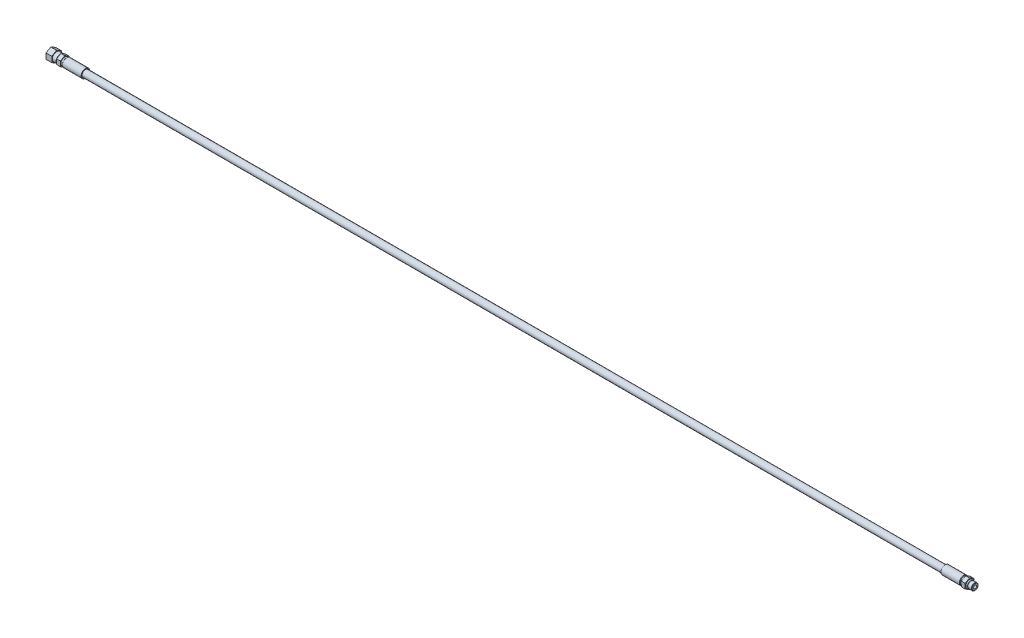
ISO-10303-21;
HEADER;
FILE_DESCRIPTION(('STEP AP214'),'2;1');
FILE_NAME('part.step','',(''),(''),'','','');
FILE_SCHEMA(('AUTOMOTIVE_DESIGN { 1 0 10303 214 1 1 1 1 }'));
ENDSEC;
DATA;
#1=APPLICATION_CONTEXT('core data for automotive mechanical design processes');
#2=APPLICATION_PROTOCOL_DEFINITION('international standard','automotive_design',2000,#1);
#3=PRODUCT_CONTEXT('',#1,'mechanical');
#4=PRODUCT('Part','Part','',(#3));
#5=PRODUCT_RELATED_PRODUCT_CATEGORY('part','',(#4));
#6=PRODUCT_DEFINITION_FORMATION('','',#4);
#7=PRODUCT_DEFINITION_CONTEXT('part definition',#1,'design');
#8=PRODUCT_DEFINITION('design','',#6,#7);
#9=PRODUCT_DEFINITION_SHAPE('','',#8);
#10=(LENGTH_UNIT() NAMED_UNIT(*) SI_UNIT(.MILLI.,.METRE.));
#11=(NAMED_UNIT(*) PLANE_ANGLE_UNIT() SI_UNIT($,.RADIAN.));
#12=(NAMED_UNIT(*) SI_UNIT($,.STERADIAN.) SOLID_ANGLE_UNIT());
#13=UNCERTAINTY_MEASURE_WITH_UNIT(LENGTH_MEASURE(1.E-05),#10,'distance_accuracy_value','');
#14=(GEOMETRIC_REPRESENTATION_CONTEXT(3) GLOBAL_UNCERTAINTY_ASSIGNED_CONTEXT((#13)) GLOBAL_UNIT_ASSIGNED_CONTEXT((#10,
#11,#12)) REPRESENTATION_CONTEXT('',''));
#15=CARTESIAN_POINT('',(0.,0.,0.));
#16=DIRECTION('',(0.,0.,1.));
#17=DIRECTION('',(1.,0.,0.));
#18=AXIS2_PLACEMENT_3D('',#15,#16,#17);
#19=CARTESIAN_POINT('',(-8.128,0.,0.));
#20=DIRECTION('',(-1.,0.,0.));
#21=DIRECTION('',(0.,0.,1.));
#22=AXIS2_PLACEMENT_3D('',#19,#20,#21);
#23=TOROIDAL_SURFACE('',#22,5.588,1.016);
#24=CARTESIAN_POINT('',(-8.128,0.,6.604));
#25=VERTEX_POINT('',#24);
#26=VERTEX_LOOP('',#25);
#27=FACE_BOUND('',#26,.T.);
#28=ADVANCED_FACE('F41',(#27),#23,.T.);
#29=CLOSED_SHELL('',(#28));
#30=MANIFOLD_SOLID_BREP('B2',#29);
#31=CARTESIAN_POINT('',(-1514.475,7.11199999999982,0.));
#32=DIRECTION('',(-1.,0.,0.));
#33=DIRECTION('',(0.,0.,1.));
#34=AXIS2_PLACEMENT_3D('',#31,#32,#33);
#35=PLANE('',#34);
#36=CARTESIAN_POINT('',(-1514.475,0.,0.));
#37=DIRECTION('',(-1.,0.,0.));
#38=DIRECTION('',(0.,0.,1.));
#39=AXIS2_PLACEMENT_3D('',#36,#37,#38);
#40=CIRCLE('',#39,7.11199999999982);
#41=CARTESIAN_POINT('',(-1514.475,0.,7.11199999999982));
#42=VERTEX_POINT('',#41);
#43=EDGE_CURVE('E321',#42,#42,#40,.T.);
#44=ORIENTED_EDGE('',*,*,#43,.T.);
#45=EDGE_LOOP('',(#44));
#46=FACE_BOUND('',#45,.T.);
#47=DIRECTION('',(0.,-0.5,0.866025403784439));
#48=VECTOR('',#47,1.);
#49=CARTESIAN_POINT('',(-1514.475,4.58271776169265,7.9375));
#50=LINE('',#49,#48);
#51=CARTESIAN_POINT('',(-1514.475,9.16543552338531,0.));
#52=VERTEX_POINT('',#51);
#53=CARTESIAN_POINT('',(-1514.475,4.58271776169265,7.9375));
#54=VERTEX_POINT('',#53);
#55=EDGE_CURVE('E210',#52,#54,#50,.T.);
#56=ORIENTED_EDGE('',*,*,#55,.T.);
#57=DIRECTION('',(0.,-1.,0.));
#58=VECTOR('',#57,1.);
#59=CARTESIAN_POINT('',(-1514.475,-4.58271776169266,7.9375));
#60=LINE('',#59,#58);
#61=CARTESIAN_POINT('',(-1514.475,-4.58271776169266,7.9375));
#62=VERTEX_POINT('',#61);
#63=EDGE_CURVE('E207',#54,#62,#60,.T.);
#64=ORIENTED_EDGE('',*,*,#63,.T.);
#65=DIRECTION('',(0.,-0.5,-0.866025403784439));
#66=VECTOR('',#65,1.);
#67=CARTESIAN_POINT('',(-1514.475,-9.16543552338531,0.));
#68=LINE('',#67,#66);
#69=CARTESIAN_POINT('',(-1514.475,-9.16543552338531,0.));
#70=VERTEX_POINT('',#69);
#71=EDGE_CURVE('E199',#62,#70,#68,.T.);
#72=ORIENTED_EDGE('',*,*,#71,.T.);
#73=DIRECTION('',(0.,0.5,-0.866025403784439));
#74=VECTOR('',#73,1.);
#75=CARTESIAN_POINT('',(-1514.475,-4.58271776169266,-7.9375));
#76=LINE('',#75,#74);
#77=CARTESIAN_POINT('',(-1514.475,-4.58271776169266,-7.9375));
#78=VERTEX_POINT('',#77);
#79=EDGE_CURVE('E197',#70,#78,#76,.T.);
#80=ORIENTED_EDGE('',*,*,#79,.T.);
#81=DIRECTION('',(0.,1.,0.));
#82=VECTOR('',#81,1.);
#83=CARTESIAN_POINT('',(-1514.475,4.58271776169266,-7.9375));
#84=LINE('',#83,#82);
#85=CARTESIAN_POINT('',(-1514.475,4.58271776169266,-7.9375));
#86=VERTEX_POINT('',#85);
#87=EDGE_CURVE('E191',#78,#86,#84,.T.);
#88=ORIENTED_EDGE('',*,*,#87,.T.);
#89=DIRECTION('',(0.,0.5,0.866025403784439));
#90=VECTOR('',#89,1.);
#91=CARTESIAN_POINT('',(-1514.475,9.16543552338531,0.));
#92=LINE('',#91,#90);
#93=EDGE_CURVE('E180',#86,#52,#92,.T.);
#94=ORIENTED_EDGE('',*,*,#93,.T.);
#95=EDGE_LOOP('',(#56,#64,#72,#80,#88,#94));
#96=FACE_BOUND('',#95,.T.);
#97=ADVANCED_FACE('F55',(#46,#96),#35,.F.);
#98=CARTESIAN_POINT('',(-1524.,19.0499999999999,0.));
#99=DIRECTION('',(1.,0.,0.));
#100=DIRECTION('',(0.,0.,-1.));
#101=AXIS2_PLACEMENT_3D('',#98,#99,#100);
#102=PLANE('',#101);
#103=CARTESIAN_POINT('',(-1524.,0.,0.));
#104=DIRECTION('',(1.,0.,0.));
#105=DIRECTION('',(0.,0.,-1.));
#106=AXIS2_PLACEMENT_3D('',#103,#104,#105);
#107=CIRCLE('',#106,6.19989534470758);
#108=CARTESIAN_POINT('',(-1524.,0.,-6.19989534470758));
#109=VERTEX_POINT('',#108);
#110=EDGE_CURVE('E549',#109,#109,#107,.T.);
#111=ORIENTED_EDGE('',*,*,#110,.T.);
#112=EDGE_LOOP('',(#111));
#113=FACE_BOUND('',#112,.T.);
#114=DIRECTION('',(0.,0.5,-0.866025403784438));
#115=VECTOR('',#114,1.);
#116=CARTESIAN_POINT('',(-1524.,4.58271776169265,7.9375));
#117=LINE('',#116,#115);
#118=CARTESIAN_POINT('',(-1524.,4.58271776169265,7.9375));
#119=VERTEX_POINT('',#118);
#120=CARTESIAN_POINT('',(-1524.,9.16543552338531,0.));
#121=VERTEX_POINT('',#120);
#122=EDGE_CURVE('E212',#119,#121,#117,.T.);
#123=ORIENTED_EDGE('',*,*,#122,.T.);
#124=DIRECTION('',(0.,-0.5,-0.866025403784439));
#125=VECTOR('',#124,1.);
#126=CARTESIAN_POINT('',(-1524.,9.16543552338531,0.));
#127=LINE('',#126,#125);
#128=CARTESIAN_POINT('',(-1524.,4.58271776169266,-7.9375));
#129=VERTEX_POINT('',#128);
#130=EDGE_CURVE('E215',#121,#129,#127,.T.);
#131=ORIENTED_EDGE('',*,*,#130,.T.);
#132=DIRECTION('',(0.,-1.,0.));
#133=VECTOR('',#132,1.);
#134=CARTESIAN_POINT('',(-1524.,4.58271776169266,-7.9375));
#135=LINE('',#134,#133);
#136=CARTESIAN_POINT('',(-1524.,-4.58271776169266,-7.9375));
#137=VERTEX_POINT('',#136);
#138=EDGE_CURVE('E79',#129,#137,#135,.T.);
#139=ORIENTED_EDGE('',*,*,#138,.T.);
#140=DIRECTION('',(0.,-0.5,0.866025403784439));
#141=VECTOR('',#140,1.);
#142=CARTESIAN_POINT('',(-1524.,-4.58271776169266,-7.9375));
#143=LINE('',#142,#141);
#144=CARTESIAN_POINT('',(-1524.,-9.16543552338531,0.));
#145=VERTEX_POINT('',#144);
#146=EDGE_CURVE('E218',#137,#145,#143,.T.);
#147=ORIENTED_EDGE('',*,*,#146,.T.);
#148=DIRECTION('',(0.,0.5,0.866025403784439));
#149=VECTOR('',#148,1.);
#150=CARTESIAN_POINT('',(-1524.,-9.16543552338531,0.));
#151=LINE('',#150,#149);
#152=CARTESIAN_POINT('',(-1524.,-4.58271776169266,7.9375));
#153=VERTEX_POINT('',#152);
#154=EDGE_CURVE('E221',#145,#153,#151,.T.);
#155=ORIENTED_EDGE('',*,*,#154,.T.);
#156=DIRECTION('',(0.,1.,0.));
#157=VECTOR('',#156,1.);
#158=CARTESIAN_POINT('',(-1524.,-4.58271776169266,7.9375));
#159=LINE('',#158,#157);
#160=EDGE_CURVE('E224',#153,#119,#159,.T.);
#161=ORIENTED_EDGE('',*,*,#160,.T.);
#162=EDGE_LOOP('',(#123,#131,#139,#147,#155,#161));
#163=FACE_BOUND('',#162,.T.);
#164=ADVANCED_FACE('F391',(#113,#163),#102,.F.);
#165=CARTESIAN_POINT('',(-9.144,4.6228,0.));
#166=DIRECTION('',(-1.,0.,0.));
#167=DIRECTION('',(0.,0.,1.));
#168=AXIS2_PLACEMENT_3D('',#165,#166,#167);
#169=PLANE('',#168);
#170=CARTESIAN_POINT('',(-9.144,0.,0.));
#171=DIRECTION('',(-1.,0.,0.));
#172=DIRECTION('',(0.,0.,1.));
#173=AXIS2_PLACEMENT_3D('',#170,#171,#172);
#174=CIRCLE('',#173,4.6228);
#175=CARTESIAN_POINT('',(-9.144,0.,4.6228));
#176=VERTEX_POINT('',#175);
#177=EDGE_CURVE('E363',#176,#176,#174,.T.);
#178=ORIENTED_EDGE('',*,*,#177,.T.);
#179=EDGE_LOOP('',(#178));
#180=FACE_BOUND('',#179,.T.);
#181=DIRECTION('',(0.,-0.5,0.866025403784439));
#182=VECTOR('',#181,1.);
#183=CARTESIAN_POINT('',(-9.144,8.21223022895324,0.));
#184=LINE('',#183,#182);
#185=CARTESIAN_POINT('',(-9.144,8.21223022895324,0.));
#186=VERTEX_POINT('',#185);
#187=CARTESIAN_POINT('',(-9.144,4.10611511447662,7.112));
#188=VERTEX_POINT('',#187);
#189=EDGE_CURVE('E253',#186,#188,#184,.T.);
#190=ORIENTED_EDGE('',*,*,#189,.T.);
#191=DIRECTION('',(0.,-1.,0.));
#192=VECTOR('',#191,1.);
#193=CARTESIAN_POINT('',(-9.144,4.10611511447662,7.112));
#194=LINE('',#193,#192);
#195=CARTESIAN_POINT('',(-9.144,-4.10611511447662,7.112));
#196=VERTEX_POINT('',#195);
#197=EDGE_CURVE('E256',#188,#196,#194,.T.);
#198=ORIENTED_EDGE('',*,*,#197,.T.);
#199=DIRECTION('',(0.,-0.5,-0.866025403784439));
#200=VECTOR('',#199,1.);
#201=CARTESIAN_POINT('',(-9.144,-4.10611511447662,7.112));
#202=LINE('',#201,#200);
#203=CARTESIAN_POINT('',(-9.144,-8.21223022895323,0.));
#204=VERTEX_POINT('',#203);
#205=EDGE_CURVE('E259',#196,#204,#202,.T.);
#206=ORIENTED_EDGE('',*,*,#205,.T.);
#207=DIRECTION('',(0.,0.5,-0.866025403784439));
#208=VECTOR('',#207,1.);
#209=CARTESIAN_POINT('',(-9.144,-8.21223022895323,0.));
#210=LINE('',#209,#208);
#211=CARTESIAN_POINT('',(-9.144,-4.10611511447662,-7.11200000000001));
#212=VERTEX_POINT('',#211);
#213=EDGE_CURVE('E262',#204,#212,#210,.T.);
#214=ORIENTED_EDGE('',*,*,#213,.T.);
#215=DIRECTION('',(0.,1.,0.));
#216=VECTOR('',#215,1.);
#217=CARTESIAN_POINT('',(-9.144,-4.10611511447662,-7.11200000000001));
#218=LINE('',#217,#216);
#219=CARTESIAN_POINT('',(-9.144,4.10611511447662,-7.112));
#220=VERTEX_POINT('',#219);
#221=EDGE_CURVE('E265',#212,#220,#218,.T.);
#222=ORIENTED_EDGE('',*,*,#221,.T.);
#223=DIRECTION('',(0.,0.5,0.866025403784439));
#224=VECTOR('',#223,1.);
#225=CARTESIAN_POINT('',(-9.144,4.10611511447662,-7.112));
#226=LINE('',#225,#224);
#227=EDGE_CURVE('E187',#220,#186,#226,.T.);
#228=ORIENTED_EDGE('',*,*,#227,.T.);
#229=EDGE_LOOP('',(#190,#198,#206,#214,#222,#228));
#230=FACE_BOUND('',#229,.T.);
#231=ADVANCED_FACE('F397',(#180,#230),#169,.F.);
#232=CARTESIAN_POINT('',(-1507.363,19.0499999999999,0.));
#233=DIRECTION('',(1.,0.,0.));
#234=DIRECTION('',(0.,0.,-1.));
#235=AXIS2_PLACEMENT_3D('',#232,#233,#234);
#236=PLANE('',#235);
#237=CARTESIAN_POINT('',(-1507.363,0.,0.));
#238=DIRECTION('',(-1.,0.,0.));
#239=DIRECTION('',(0.,0.,1.));
#240=AXIS2_PLACEMENT_3D('',#237,#238,#239);
#241=CIRCLE('',#240,6.34999999999982);
#242=CARTESIAN_POINT('',(-1507.363,0.,6.34999999999982));
#243=VERTEX_POINT('',#242);
#244=EDGE_CURVE('E330',#243,#243,#241,.T.);
#245=ORIENTED_EDGE('',*,*,#244,.F.);
#246=EDGE_LOOP('',(#245));
#247=FACE_BOUND('',#246,.T.);
#248=DIRECTION('',(0.,0.5,-0.866025403784439));
#249=VECTOR('',#248,1.);
#250=CARTESIAN_POINT('',(-1507.363,8.21223022895324,0.));
#251=LINE('',#250,#249);
#252=CARTESIAN_POINT('',(-1507.363,4.10611511447663,7.112));
#253=VERTEX_POINT('',#252);
#254=CARTESIAN_POINT('',(-1507.363,8.21223022895324,0.));
#255=VERTEX_POINT('',#254);
#256=EDGE_CURVE('E250',#253,#255,#251,.T.);
#257=ORIENTED_EDGE('',*,*,#256,.T.);
#258=DIRECTION('',(0.,-0.5,-0.866025403784439));
#259=VECTOR('',#258,1.);
#260=CARTESIAN_POINT('',(-1507.363,4.10611511447662,-7.112));
#261=LINE('',#260,#259);
#262=CARTESIAN_POINT('',(-1507.363,4.10611511447662,-7.112));
#263=VERTEX_POINT('',#262);
#264=EDGE_CURVE('E247',#255,#263,#261,.T.);
#265=ORIENTED_EDGE('',*,*,#264,.T.);
#266=DIRECTION('',(0.,-1.,0.));
#267=VECTOR('',#266,1.);
#268=CARTESIAN_POINT('',(-1507.363,-4.10611511447662,-7.11200000000001));
#269=LINE('',#268,#267);
#270=CARTESIAN_POINT('',(-1507.363,-4.10611511447662,-7.11200000000001));
#271=VERTEX_POINT('',#270);
#272=EDGE_CURVE('E244',#263,#271,#269,.T.);
#273=ORIENTED_EDGE('',*,*,#272,.T.);
#274=DIRECTION('',(0.,-0.5,0.866025403784439));
#275=VECTOR('',#274,1.);
#276=CARTESIAN_POINT('',(-1507.363,-8.21223022895323,0.));
#277=LINE('',#276,#275);
#278=CARTESIAN_POINT('',(-1507.363,-8.21223022895323,0.));
#279=VERTEX_POINT('',#278);
#280=EDGE_CURVE('E241',#271,#279,#277,.T.);
#281=ORIENTED_EDGE('',*,*,#280,.T.);
#282=DIRECTION('',(0.,0.5,0.866025403784439));
#283=VECTOR('',#282,1.);
#284=CARTESIAN_POINT('',(-1507.363,-4.10611511447662,7.112));
#285=LINE('',#284,#283);
#286=CARTESIAN_POINT('',(-1507.363,-4.10611511447662,7.112));
#287=VERTEX_POINT('',#286);
#288=EDGE_CURVE('E238',#279,#287,#285,.T.);
#289=ORIENTED_EDGE('',*,*,#288,.T.);
#290=DIRECTION('',(0.,1.,0.));
#291=VECTOR('',#290,1.);
#292=CARTESIAN_POINT('',(-1507.363,4.10611511447662,7.112));
#293=LINE('',#292,#291);
#294=EDGE_CURVE('E234',#287,#253,#293,.T.);
#295=ORIENTED_EDGE('',*,*,#294,.T.);
#296=EDGE_LOOP('',(#257,#265,#273,#281,#289,#295));
#297=FACE_BOUND('',#296,.T.);
#298=ADVANCED_FACE('F416',(#247,#297),#236,.F.);
#299=CARTESIAN_POINT('',(0.,2.413,0.));
#300=DIRECTION('',(-1.,0.,0.));
#301=DIRECTION('',(0.,0.,1.));
#302=AXIS2_PLACEMENT_3D('',#299,#300,#301);
#303=PLANE('',#302);
#304=CARTESIAN_POINT('',(0.,0.,0.));
#305=DIRECTION('',(-1.,0.,0.));
#306=DIRECTION('',(0.,0.,1.));
#307=AXIS2_PLACEMENT_3D('',#304,#305,#306);
#308=CIRCLE('',#307,4.85139999999995);
#309=CARTESIAN_POINT('',(0.,0.,4.85139999999995));
#310=VERTEX_POINT('',#309);
#311=EDGE_CURVE('E39',#310,#310,#308,.F.);
#312=ORIENTED_EDGE('',*,*,#311,.T.);
#313=EDGE_LOOP('',(#312));
#314=FACE_BOUND('',#313,.T.);
#315=CARTESIAN_POINT('',(0.,0.,0.));
#316=DIRECTION('',(-1.,0.,0.));
#317=DIRECTION('',(0.,0.,1.));
#318=AXIS2_PLACEMENT_3D('',#315,#316,#317);
#319=CIRCLE('',#318,2.413);
#320=CARTESIAN_POINT('',(0.,0.,2.413));
#321=VERTEX_POINT('',#320);
#322=EDGE_CURVE('E318',#321,#321,#319,.T.);
#323=ORIENTED_EDGE('',*,*,#322,.T.);
#324=EDGE_LOOP('',(#323));
#325=FACE_BOUND('',#324,.T.);
#326=ADVANCED_FACE('F419',(#314,#325),#303,.F.);
#327=CARTESIAN_POINT('',(0.,0.,0.));
#328=DIRECTION('',(-1.,0.,0.));
#329=DIRECTION('',(0.,0.,1.));
#330=AXIS2_PLACEMENT_3D('',#327,#328,#329);
#331=CYLINDRICAL_SURFACE('',#330,5.5372);
#332=CARTESIAN_POINT('',(-0.68580000000003,0.,0.));
#333=DIRECTION('',(-1.,0.,0.));
#334=DIRECTION('',(0.,0.,1.));
#335=AXIS2_PLACEMENT_3D('',#332,#333,#334);
#336=CIRCLE('',#335,5.5372);
#337=CARTESIAN_POINT('',(-0.68580000000003,0.,5.5372));
#338=VERTEX_POINT('',#337);
#339=EDGE_CURVE('E64',#338,#338,#336,.T.);
#340=ORIENTED_EDGE('',*,*,#339,.T.);
#341=EDGE_LOOP('',(#340));
#342=FACE_BOUND('',#341,.T.);
#343=CARTESIAN_POINT('',(-6.3246,0.,0.));
#344=DIRECTION('',(-1.,0.,0.));
#345=DIRECTION('',(0.,0.,1.));
#346=AXIS2_PLACEMENT_3D('',#343,#344,#345);
#347=CIRCLE('',#346,5.5372);
#348=CARTESIAN_POINT('',(-6.3246,0.,5.5372));
#349=VERTEX_POINT('',#348);
#350=EDGE_CURVE('E369',#349,#349,#347,.T.);
#351=ORIENTED_EDGE('',*,*,#350,.F.);
#352=EDGE_LOOP('',(#351));
#353=FACE_BOUND('',#352,.T.);
#354=ADVANCED_FACE('F375',(#342,#353),#331,.T.);
#355=CARTESIAN_POINT('',(-6.3246,0.,0.));
#356=DIRECTION('',(1.,0.,0.));
#357=DIRECTION('',(0.,0.,-1.));
#358=AXIS2_PLACEMENT_3D('',#355,#356,#357);
#359=CONICAL_SURFACE('',#358,5.5372,0.785398163397449);
#360=CARTESIAN_POINT('',(-7.239,0.,0.));
#361=DIRECTION('',(-1.,0.,0.));
#362=DIRECTION('',(0.,0.,1.));
#363=AXIS2_PLACEMENT_3D('',#360,#361,#362);
#364=CIRCLE('',#363,4.6228);
#365=CARTESIAN_POINT('',(-7.239,0.,4.6228));
#366=VERTEX_POINT('',#365);
#367=EDGE_CURVE('E366',#366,#366,#364,.T.);
#368=ORIENTED_EDGE('',*,*,#367,.F.);
#369=EDGE_LOOP('',(#368));
#370=FACE_BOUND('',#369,.T.);
#371=ORIENTED_EDGE('',*,*,#350,.T.);
#372=EDGE_LOOP('',(#371));
#373=FACE_BOUND('',#372,.T.);
#374=ADVANCED_FACE('F472',(#370,#373),#359,.T.);
#375=CARTESIAN_POINT('',(0.,0.,0.));
#376=DIRECTION('',(-1.,0.,0.));
#377=DIRECTION('',(0.,0.,1.));
#378=AXIS2_PLACEMENT_3D('',#375,#376,#377);
#379=CYLINDRICAL_SURFACE('',#378,4.6228);
#380=ORIENTED_EDGE('',*,*,#177,.F.);
#381=EDGE_LOOP('',(#380));
#382=FACE_BOUND('',#381,.T.);
#383=ORIENTED_EDGE('',*,*,#367,.T.);
#384=EDGE_LOOP('',(#383));
#385=FACE_BOUND('',#384,.T.);
#386=ADVANCED_FACE('F414',(#382,#385),#379,.T.);
#387=CARTESIAN_POINT('',(0.,0.,0.));
#388=DIRECTION('',(-1.,0.,0.));
#389=DIRECTION('',(0.,0.,1.));
#390=AXIS2_PLACEMENT_3D('',#387,#388,#389);
#391=CYLINDRICAL_SURFACE('',#390,6.34999999999982);
#392=CARTESIAN_POINT('',(-1508.125,0.,0.));
#393=DIRECTION('',(-1.,0.,0.));
#394=DIRECTION('',(0.,0.,1.));
#395=AXIS2_PLACEMENT_3D('',#392,#393,#394);
#396=CIRCLE('',#395,6.34999999999982);
#397=CARTESIAN_POINT('',(-1508.125,0.,6.34999999999982));
#398=VERTEX_POINT('',#397);
#399=EDGE_CURVE('E327',#398,#398,#396,.T.);
#400=ORIENTED_EDGE('',*,*,#399,.F.);
#401=EDGE_LOOP('',(#400));
#402=FACE_BOUND('',#401,.T.);
#403=ORIENTED_EDGE('',*,*,#244,.T.);
#404=EDGE_LOOP('',(#403));
#405=FACE_BOUND('',#404,.T.);
#406=ADVANCED_FACE('F410',(#402,#405),#391,.T.);
#407=CARTESIAN_POINT('',(-1508.125,6.34999999999982,0.));
#408=DIRECTION('',(-1.,0.,0.));
#409=DIRECTION('',(0.,0.,1.));
#410=AXIS2_PLACEMENT_3D('',#407,#408,#409);
#411=PLANE('',#410);
#412=CARTESIAN_POINT('',(-1508.125,0.,0.));
#413=DIRECTION('',(-1.,0.,0.));
#414=DIRECTION('',(0.,0.,1.));
#415=AXIS2_PLACEMENT_3D('',#412,#413,#414);
#416=CIRCLE('',#415,7.11199999999982);
#417=CARTESIAN_POINT('',(-1508.125,0.,7.11199999999982));
#418=VERTEX_POINT('',#417);
#419=EDGE_CURVE('E324',#418,#418,#416,.T.);
#420=ORIENTED_EDGE('',*,*,#419,.F.);
#421=EDGE_LOOP('',(#420));
#422=FACE_BOUND('',#421,.T.);
#423=ORIENTED_EDGE('',*,*,#399,.T.);
#424=EDGE_LOOP('',(#423));
#425=FACE_BOUND('',#424,.T.);
#426=ADVANCED_FACE('F406',(#422,#425),#411,.F.);
#427=CARTESIAN_POINT('',(0.,0.,0.));
#428=DIRECTION('',(-1.,0.,0.));
#429=DIRECTION('',(0.,0.,1.));
#430=AXIS2_PLACEMENT_3D('',#427,#428,#429);
#431=CYLINDRICAL_SURFACE('',#430,7.11199999999982);
#432=ORIENTED_EDGE('',*,*,#43,.F.);
#433=EDGE_LOOP('',(#432));
#434=FACE_BOUND('',#433,.T.);
#435=ORIENTED_EDGE('',*,*,#419,.T.);
#436=EDGE_LOOP('',(#435));
#437=FACE_BOUND('',#436,.T.);
#438=ADVANCED_FACE('F402',(#434,#437),#431,.T.);
#439=CARTESIAN_POINT('',(0.,0.,0.));
#440=DIRECTION('',(-1.,0.,0.));
#441=DIRECTION('',(0.,0.,1.));
#442=AXIS2_PLACEMENT_3D('',#439,#440,#441);
#443=CYLINDRICAL_SURFACE('',#442,2.413);
#444=CARTESIAN_POINT('',(-1509.76923546975,0.,0.));
#445=DIRECTION('',(-1.,0.,0.));
#446=DIRECTION('',(0.,0.,1.));
#447=AXIS2_PLACEMENT_3D('',#444,#445,#446);
#448=CIRCLE('',#447,2.413);
#449=CARTESIAN_POINT('',(-1509.76923546975,0.,2.413));
#450=VERTEX_POINT('',#449);
#451=EDGE_CURVE('E59',#450,#450,#448,.T.);
#452=ORIENTED_EDGE('',*,*,#451,.T.);
#453=EDGE_LOOP('',(#452));
#454=FACE_BOUND('',#453,.T.);
#455=ORIENTED_EDGE('',*,*,#322,.F.);
#456=EDGE_LOOP('',(#455));
#457=FACE_BOUND('',#456,.T.);
#458=ADVANCED_FACE('F405',(#454,#457),#443,.F.);
#459=CARTESIAN_POINT('',(-1561.24453672641,4.10611511447662,-7.112));
#460=DIRECTION('',(0.,0.866025403784439,-0.5));
#461=DIRECTION('',(0.,0.5,0.866025403784439));
#462=AXIS2_PLACEMENT_3D('',#459,#460,#461);
#463=PLANE('',#462);
#464=DIRECTION('',(0.,-0.5,-0.866025403784439));
#465=VECTOR('',#464,1.);
#466=CARTESIAN_POINT('',(-1501.013,7.74667267171488,-0.806369342984488));
#467=LINE('',#466,#465);
#468=CARTESIAN_POINT('',(-1501.013,8.21223022895324,0.));
#469=VERTEX_POINT('',#468);
#470=CARTESIAN_POINT('',(-1501.013,4.10611511447662,-7.112));
#471=VERTEX_POINT('',#470);
#472=EDGE_CURVE('E237',#469,#471,#467,.T.);
#473=ORIENTED_EDGE('',*,*,#472,.T.);
#474=DIRECTION('',(1.,0.,0.));
#475=VECTOR('',#474,1.);
#476=CARTESIAN_POINT('',(-1561.24453672641,4.10611511447662,-7.112));
#477=LINE('',#476,#475);
#478=EDGE_CURVE('E269',#263,#471,#477,.T.);
#479=ORIENTED_EDGE('',*,*,#478,.F.);
#480=ORIENTED_EDGE('',*,*,#264,.F.);
#481=DIRECTION('',(1.,0.,0.));
#482=VECTOR('',#481,1.);
#483=CARTESIAN_POINT('',(-1561.24453672641,8.21223022895324,0.));
#484=LINE('',#483,#482);
#485=EDGE_CURVE('E289',#255,#469,#484,.T.);
#486=ORIENTED_EDGE('',*,*,#485,.T.);
#487=EDGE_LOOP('',(#473,#479,#480,#486));
#488=FACE_BOUND('',#487,.T.);
#489=ADVANCED_FACE('F486',(#488),#463,.T.);
#490=CARTESIAN_POINT('',(-1561.24453672641,-4.10611511447662,-7.11200000000001));
#491=DIRECTION('',(0.,0.,-1.));
#492=DIRECTION('',(0.,1.,0.));
#493=AXIS2_PLACEMENT_3D('',#490,#491,#492);
#494=PLANE('',#493);
#495=DIRECTION('',(0.,-1.,0.));
#496=VECTOR('',#495,1.);
#497=CARTESIAN_POINT('',(-1501.013,6.34999999999982,-7.112));
#498=LINE('',#497,#496);
#499=CARTESIAN_POINT('',(-1501.013,-4.10611511447662,-7.11200000000001));
#500=VERTEX_POINT('',#499);
#501=EDGE_CURVE('E296',#471,#500,#498,.T.);
#502=ORIENTED_EDGE('',*,*,#501,.T.);
#503=DIRECTION('',(1.,0.,0.));
#504=VECTOR('',#503,1.);
#505=CARTESIAN_POINT('',(-1561.24453672641,-4.10611511447662,-7.11200000000001));
#506=LINE('',#505,#504);
#507=EDGE_CURVE('E273',#271,#500,#506,.T.);
#508=ORIENTED_EDGE('',*,*,#507,.F.);
#509=ORIENTED_EDGE('',*,*,#272,.F.);
#510=ORIENTED_EDGE('',*,*,#478,.T.);
#511=EDGE_LOOP('',(#502,#508,#509,#510));
#512=FACE_BOUND('',#511,.T.);
#513=ADVANCED_FACE('F491',(#512),#494,.T.);
#514=CARTESIAN_POINT('',(-1561.24453672641,-8.21223022895323,0.));
#515=DIRECTION('',(0.,-0.866025403784439,-0.5));
#516=DIRECTION('',(0.,0.5,-0.866025403784439));
#517=AXIS2_PLACEMENT_3D('',#514,#515,#516);
#518=PLANE('',#517);
#519=DIRECTION('',(0.,-0.5,0.866025403784439));
#520=VECTOR('',#519,1.);
#521=CARTESIAN_POINT('',(-1501.013,-4.57167267171497,-6.30563065701551));
#522=LINE('',#521,#520);
#523=CARTESIAN_POINT('',(-1501.013,-8.21223022895323,0.));
#524=VERTEX_POINT('',#523);
#525=EDGE_CURVE('E301',#500,#524,#522,.T.);
#526=ORIENTED_EDGE('',*,*,#525,.T.);
#527=DIRECTION('',(1.,0.,0.));
#528=VECTOR('',#527,1.);
#529=CARTESIAN_POINT('',(-1561.24453672641,-8.21223022895323,0.));
#530=LINE('',#529,#528);
#531=EDGE_CURVE('E277',#279,#524,#530,.T.);
#532=ORIENTED_EDGE('',*,*,#531,.F.);
#533=ORIENTED_EDGE('',*,*,#280,.F.);
#534=ORIENTED_EDGE('',*,*,#507,.T.);
#535=EDGE_LOOP('',(#526,#532,#533,#534));
#536=FACE_BOUND('',#535,.T.);
#537=ADVANCED_FACE('F517',(#536),#518,.T.);
#538=CARTESIAN_POINT('',(-1561.24453672641,-4.10611511447662,7.112));
#539=DIRECTION('',(0.,-0.866025403784439,0.5));
#540=DIRECTION('',(0.,-0.5,-0.866025403784439));
#541=AXIS2_PLACEMENT_3D('',#538,#539,#540);
#542=PLANE('',#541);
#543=DIRECTION('',(0.,0.5,0.866025403784439));
#544=VECTOR('',#543,1.);
#545=CARTESIAN_POINT('',(-1501.013,-4.57167267171497,6.30563065701551));
#546=LINE('',#545,#544);
#547=CARTESIAN_POINT('',(-1501.013,-4.10611511447662,7.112));
#548=VERTEX_POINT('',#547);
#549=EDGE_CURVE('E305',#524,#548,#546,.T.);
#550=ORIENTED_EDGE('',*,*,#549,.T.);
#551=DIRECTION('',(1.,0.,0.));
#552=VECTOR('',#551,1.);
#553=CARTESIAN_POINT('',(-1561.24453672641,-4.10611511447662,7.112));
#554=LINE('',#553,#552);
#555=EDGE_CURVE('E281',#287,#548,#554,.T.);
#556=ORIENTED_EDGE('',*,*,#555,.F.);
#557=ORIENTED_EDGE('',*,*,#288,.F.);
#558=ORIENTED_EDGE('',*,*,#531,.T.);
#559=EDGE_LOOP('',(#550,#556,#557,#558));
#560=FACE_BOUND('',#559,.T.);
#561=ADVANCED_FACE('F513',(#560),#542,.T.);
#562=CARTESIAN_POINT('',(-1561.24453672641,4.10611511447662,7.112));
#563=DIRECTION('',(0.,0.,1.));
#564=DIRECTION('',(0.,-1.,0.));
#565=AXIS2_PLACEMENT_3D('',#562,#563,#564);
#566=PLANE('',#565);
#567=DIRECTION('',(0.,1.,0.));
#568=VECTOR('',#567,1.);
#569=CARTESIAN_POINT('',(-1501.013,6.34999999999982,7.112));
#570=LINE('',#569,#568);
#571=CARTESIAN_POINT('',(-1501.013,4.10611511447662,7.112));
#572=VERTEX_POINT('',#571);
#573=EDGE_CURVE('E309',#548,#572,#570,.T.);
#574=ORIENTED_EDGE('',*,*,#573,.T.);
#575=DIRECTION('',(1.,0.,0.));
#576=VECTOR('',#575,1.);
#577=CARTESIAN_POINT('',(-1561.24453672641,4.10611511447662,7.112));
#578=LINE('',#577,#576);
#579=EDGE_CURVE('E285',#253,#572,#578,.T.);
#580=ORIENTED_EDGE('',*,*,#579,.F.);
#581=ORIENTED_EDGE('',*,*,#294,.F.);
#582=ORIENTED_EDGE('',*,*,#555,.T.);
#583=EDGE_LOOP('',(#574,#580,#581,#582));
#584=FACE_BOUND('',#583,.T.);
#585=ADVANCED_FACE('F508',(#584),#566,.T.);
#586=CARTESIAN_POINT('',(-1561.24453672641,8.21223022895324,0.));
#587=DIRECTION('',(0.,0.866025403784439,0.5));
#588=DIRECTION('',(0.,-0.5,0.866025403784439));
#589=AXIS2_PLACEMENT_3D('',#586,#587,#588);
#590=PLANE('',#589);
#591=DIRECTION('',(0.,0.5,-0.866025403784439));
#592=VECTOR('',#591,1.);
#593=CARTESIAN_POINT('',(-1501.013,7.74667267171489,0.806369342984487));
#594=LINE('',#593,#592);
#595=EDGE_CURVE('E313',#572,#469,#594,.T.);
#596=ORIENTED_EDGE('',*,*,#595,.T.);
#597=ORIENTED_EDGE('',*,*,#485,.F.);
#598=ORIENTED_EDGE('',*,*,#256,.F.);
#599=ORIENTED_EDGE('',*,*,#579,.T.);
#600=EDGE_LOOP('',(#596,#597,#598,#599));
#601=FACE_BOUND('',#600,.T.);
#602=ADVANCED_FACE('F451',(#601),#590,.T.);
#603=CARTESIAN_POINT('',(-49.276,7.112,0.));
#604=DIRECTION('',(1.,0.,0.));
#605=DIRECTION('',(0.,0.,-1.));
#606=AXIS2_PLACEMENT_3D('',#603,#604,#605);
#607=PLANE('',#606);
#608=CARTESIAN_POINT('',(-49.276,0.,0.));
#609=DIRECTION('',(-1.,0.,0.));
#610=DIRECTION('',(0.,0.,1.));
#611=AXIS2_PLACEMENT_3D('',#608,#609,#610);
#612=CIRCLE('',#611,5.588);
#613=CARTESIAN_POINT('',(-49.276,0.,5.588));
#614=VERTEX_POINT('',#613);
#615=EDGE_CURVE('E348',#614,#614,#612,.T.);
#616=ORIENTED_EDGE('',*,*,#615,.F.);
#617=EDGE_LOOP('',(#616));
#618=FACE_BOUND('',#617,.T.);
#619=CARTESIAN_POINT('',(-49.276,0.,0.));
#620=DIRECTION('',(-1.,0.,0.));
#621=DIRECTION('',(0.,0.,1.));
#622=AXIS2_PLACEMENT_3D('',#619,#620,#621);
#623=CIRCLE('',#622,7.112);
#624=CARTESIAN_POINT('',(-49.276,0.,7.112));
#625=VERTEX_POINT('',#624);
#626=EDGE_CURVE('E351',#625,#625,#623,.T.);
#627=ORIENTED_EDGE('',*,*,#626,.T.);
#628=EDGE_LOOP('',(#627));
#629=FACE_BOUND('',#628,.T.);
#630=ADVANCED_FACE('F447',(#618,#629),#607,.F.);
#631=CARTESIAN_POINT('',(0.,0.,0.));
#632=DIRECTION('',(-1.,0.,0.));
#633=DIRECTION('',(0.,0.,1.));
#634=AXIS2_PLACEMENT_3D('',#631,#632,#633);
#635=CYLINDRICAL_SURFACE('',#634,7.112);
#636=ORIENTED_EDGE('',*,*,#626,.F.);
#637=EDGE_LOOP('',(#636));
#638=FACE_BOUND('',#637,.T.);
#639=CARTESIAN_POINT('',(-18.796,0.,0.));
#640=DIRECTION('',(-1.,0.,0.));
#641=DIRECTION('',(0.,0.,1.));
#642=AXIS2_PLACEMENT_3D('',#639,#640,#641);
#643=CIRCLE('',#642,7.112);
#644=CARTESIAN_POINT('',(-18.796,0.,7.112));
#645=VERTEX_POINT('',#644);
#646=EDGE_CURVE('E354',#645,#645,#643,.T.);
#647=ORIENTED_EDGE('',*,*,#646,.T.);
#648=EDGE_LOOP('',(#647));
#649=FACE_BOUND('',#648,.T.);
#650=ADVANCED_FACE('F450',(#638,#649),#635,.T.);
#651=CARTESIAN_POINT('',(-18.034,0.,0.));
#652=DIRECTION('',(-1.,0.,0.));
#653=DIRECTION('',(0.,0.,1.));
#654=AXIS2_PLACEMENT_3D('',#651,#652,#653);
#655=CONICAL_SURFACE('',#654,6.35,0.785398163397438);
#656=ORIENTED_EDGE('',*,*,#646,.F.);
#657=EDGE_LOOP('',(#656));
#658=FACE_BOUND('',#657,.T.);
#659=CARTESIAN_POINT('',(-18.034,0.,0.));
#660=DIRECTION('',(-1.,0.,0.));
#661=DIRECTION('',(0.,0.,1.));
#662=AXIS2_PLACEMENT_3D('',#659,#660,#661);
#663=CIRCLE('',#662,6.35);
#664=CARTESIAN_POINT('',(-18.034,0.,6.35));
#665=VERTEX_POINT('',#664);
#666=EDGE_CURVE('E357',#665,#665,#663,.T.);
#667=ORIENTED_EDGE('',*,*,#666,.T.);
#668=EDGE_LOOP('',(#667));
#669=FACE_BOUND('',#668,.T.);
#670=ADVANCED_FACE('F455',(#658,#669),#655,.T.);
#671=CARTESIAN_POINT('',(0.,0.,0.));
#672=DIRECTION('',(-1.,0.,0.));
#673=DIRECTION('',(0.,0.,1.));
#674=AXIS2_PLACEMENT_3D('',#671,#672,#673);
#675=CYLINDRICAL_SURFACE('',#674,6.35);
#676=ORIENTED_EDGE('',*,*,#666,.F.);
#677=EDGE_LOOP('',(#676));
#678=FACE_BOUND('',#677,.T.);
#679=CARTESIAN_POINT('',(-15.494,0.,0.));
#680=DIRECTION('',(-1.,0.,0.));
#681=DIRECTION('',(0.,0.,1.));
#682=AXIS2_PLACEMENT_3D('',#679,#680,#681);
#683=CIRCLE('',#682,6.35);
#684=CARTESIAN_POINT('',(-15.494,0.,6.35));
#685=VERTEX_POINT('',#684);
#686=EDGE_CURVE('E360',#685,#685,#683,.T.);
#687=ORIENTED_EDGE('',*,*,#686,.T.);
#688=EDGE_LOOP('',(#687));
#689=FACE_BOUND('',#688,.T.);
#690=ADVANCED_FACE('F459',(#678,#689),#675,.T.);
#691=CARTESIAN_POINT('',(-15.494,19.05,0.));
#692=DIRECTION('',(1.,0.,0.));
#693=DIRECTION('',(0.,0.,-1.));
#694=AXIS2_PLACEMENT_3D('',#691,#692,#693);
#695=PLANE('',#694);
#696=ORIENTED_EDGE('',*,*,#686,.F.);
#697=EDGE_LOOP('',(#696));
#698=FACE_BOUND('',#697,.T.);
#699=DIRECTION('',(0.,-0.5,0.866025403784439));
#700=VECTOR('',#699,1.);
#701=CARTESIAN_POINT('',(-15.494,10.9216726717149,-4.69289197104678));
#702=LINE('',#701,#700);
#703=CARTESIAN_POINT('',(-15.4939999999999,8.21223022895324,0.));
#704=VERTEX_POINT('',#703);
#705=CARTESIAN_POINT('',(-15.4939999999999,4.10611511447662,7.112));
#706=VERTEX_POINT('',#705);
#707=EDGE_CURVE('E316',#704,#706,#702,.T.);
#708=ORIENTED_EDGE('',*,*,#707,.F.);
#709=DIRECTION('',(0.,0.5,0.866025403784439));
#710=VECTOR('',#709,1.);
#711=CARTESIAN_POINT('',(-15.494,10.9216726717149,4.69289197104678));
#712=LINE('',#711,#710);
#713=CARTESIAN_POINT('',(-15.494,4.10611511447662,-7.112));
#714=VERTEX_POINT('',#713);
#715=EDGE_CURVE('E294',#714,#704,#712,.T.);
#716=ORIENTED_EDGE('',*,*,#715,.F.);
#717=DIRECTION('',(0.,1.,0.));
#718=VECTOR('',#717,1.);
#719=CARTESIAN_POINT('',(-15.494,19.05,-7.112));
#720=LINE('',#719,#718);
#721=CARTESIAN_POINT('',(-15.4939999999999,-4.10611511447662,-7.11200000000001));
#722=VERTEX_POINT('',#721);
#723=EDGE_CURVE('E298',#722,#714,#720,.T.);
#724=ORIENTED_EDGE('',*,*,#723,.F.);
#725=DIRECTION('',(0.,0.5,-0.866025403784439));
#726=VECTOR('',#725,1.);
#727=CARTESIAN_POINT('',(-15.494,-1.39667267171493,-11.8048919710468));
#728=LINE('',#727,#726);
#729=CARTESIAN_POINT('',(-15.4939999999999,-8.21223022895323,0.));
#730=VERTEX_POINT('',#729);
#731=EDGE_CURVE('E303',#730,#722,#728,.T.);
#732=ORIENTED_EDGE('',*,*,#731,.F.);
#733=DIRECTION('',(0.,-0.5,-0.866025403784439));
#734=VECTOR('',#733,1.);
#735=CARTESIAN_POINT('',(-15.494,-1.39667267171494,11.8048919710468));
#736=LINE('',#735,#734);
#737=CARTESIAN_POINT('',(-15.4939999999999,-4.10611511447662,7.112));
#738=VERTEX_POINT('',#737);
#739=EDGE_CURVE('E307',#738,#730,#736,.T.);
#740=ORIENTED_EDGE('',*,*,#739,.F.);
#741=DIRECTION('',(0.,-1.,0.));
#742=VECTOR('',#741,1.);
#743=CARTESIAN_POINT('',(-15.494,19.05,7.112));
#744=LINE('',#743,#742);
#745=EDGE_CURVE('E311',#706,#738,#744,.T.);
#746=ORIENTED_EDGE('',*,*,#745,.F.);
#747=EDGE_LOOP('',(#708,#716,#724,#732,#740,#746));
#748=FACE_BOUND('',#747,.T.);
#749=ADVANCED_FACE('F445',(#698,#748),#695,.F.);
#750=CARTESIAN_POINT('',(0.,0.,0.));
#751=DIRECTION('',(-1.,0.,0.));
#752=DIRECTION('',(0.,0.,1.));
#753=AXIS2_PLACEMENT_3D('',#750,#751,#752);
#754=CYLINDRICAL_SURFACE('',#753,5.58799999999991);
#755=CARTESIAN_POINT('',(-1466.85,0.,0.));
#756=DIRECTION('',(-1.,0.,0.));
#757=DIRECTION('',(0.,0.,1.));
#758=AXIS2_PLACEMENT_3D('',#755,#756,#757);
#759=CIRCLE('',#758,5.58799999999983);
#760=CARTESIAN_POINT('',(-1466.85,0.,5.58799999999983));
#761=VERTEX_POINT('',#760);
#762=EDGE_CURVE('E345',#761,#761,#759,.T.);
#763=ORIENTED_EDGE('',*,*,#762,.F.);
#764=EDGE_LOOP('',(#763));
#765=FACE_BOUND('',#764,.T.);
#766=ORIENTED_EDGE('',*,*,#615,.T.);
#767=EDGE_LOOP('',(#766));
#768=FACE_BOUND('',#767,.T.);
#769=ADVANCED_FACE('F441',(#765,#768),#754,.T.);
#770=CARTESIAN_POINT('',(-1466.85,5.58799999999983,0.));
#771=DIRECTION('',(-1.,0.,0.));
#772=DIRECTION('',(0.,0.,1.));
#773=AXIS2_PLACEMENT_3D('',#770,#771,#772);
#774=PLANE('',#773);
#775=CARTESIAN_POINT('',(-1466.85,0.,0.));
#776=DIRECTION('',(-1.,0.,0.));
#777=DIRECTION('',(0.,0.,1.));
#778=AXIS2_PLACEMENT_3D('',#775,#776,#777);
#779=CIRCLE('',#778,7.11199999999982);
#780=CARTESIAN_POINT('',(-1466.85,0.,7.11199999999982));
#781=VERTEX_POINT('',#780);
#782=EDGE_CURVE('E342',#781,#781,#779,.T.);
#783=ORIENTED_EDGE('',*,*,#782,.F.);
#784=EDGE_LOOP('',(#783));
#785=FACE_BOUND('',#784,.T.);
#786=ORIENTED_EDGE('',*,*,#762,.T.);
#787=EDGE_LOOP('',(#786));
#788=FACE_BOUND('',#787,.T.);
#789=ADVANCED_FACE('F437',(#785,#788),#774,.F.);
#790=CARTESIAN_POINT('',(0.,0.,0.));
#791=DIRECTION('',(-1.,0.,0.));
#792=DIRECTION('',(0.,0.,1.));
#793=AXIS2_PLACEMENT_3D('',#790,#791,#792);
#794=CYLINDRICAL_SURFACE('',#793,7.11199999999982);
#795=CARTESIAN_POINT('',(-1497.711,0.,0.));
#796=DIRECTION('',(-1.,0.,0.));
#797=DIRECTION('',(0.,0.,1.));
#798=AXIS2_PLACEMENT_3D('',#795,#796,#797);
#799=CIRCLE('',#798,7.11199999999982);
#800=CARTESIAN_POINT('',(-1497.711,0.,7.11199999999982));
#801=VERTEX_POINT('',#800);
#802=EDGE_CURVE('E339',#801,#801,#799,.T.);
#803=ORIENTED_EDGE('',*,*,#802,.F.);
#804=EDGE_LOOP('',(#803));
#805=FACE_BOUND('',#804,.T.);
#806=ORIENTED_EDGE('',*,*,#782,.T.);
#807=EDGE_LOOP('',(#806));
#808=FACE_BOUND('',#807,.T.);
#809=ADVANCED_FACE('F433',(#805,#808),#794,.T.);
#810=CARTESIAN_POINT('',(-1497.711,0.,0.));
#811=DIRECTION('',(1.,0.,0.));
#812=DIRECTION('',(0.,0.,-1.));
#813=AXIS2_PLACEMENT_3D('',#810,#811,#812);
#814=CONICAL_SURFACE('',#813,7.11199999999982,0.785398163397495);
#815=CARTESIAN_POINT('',(-1498.473,0.,0.));
#816=DIRECTION('',(-1.,0.,0.));
#817=DIRECTION('',(0.,0.,1.));
#818=AXIS2_PLACEMENT_3D('',#815,#816,#817);
#819=CIRCLE('',#818,6.34999999999982);
#820=CARTESIAN_POINT('',(-1498.473,0.,6.34999999999982));
#821=VERTEX_POINT('',#820);
#822=EDGE_CURVE('E336',#821,#821,#819,.T.);
#823=ORIENTED_EDGE('',*,*,#822,.F.);
#824=EDGE_LOOP('',(#823));
#825=FACE_BOUND('',#824,.T.);
#826=ORIENTED_EDGE('',*,*,#802,.T.);
#827=EDGE_LOOP('',(#826));
#828=FACE_BOUND('',#827,.T.);
#829=ADVANCED_FACE('F429',(#825,#828),#814,.T.);
#830=CARTESIAN_POINT('',(0.,0.,0.));
#831=DIRECTION('',(-1.,0.,0.));
#832=DIRECTION('',(0.,0.,1.));
#833=AXIS2_PLACEMENT_3D('',#830,#831,#832);
#834=CYLINDRICAL_SURFACE('',#833,6.34999999999982);
#835=CARTESIAN_POINT('',(-1501.013,0.,0.));
#836=DIRECTION('',(-1.,0.,0.));
#837=DIRECTION('',(0.,0.,1.));
#838=AXIS2_PLACEMENT_3D('',#835,#836,#837);
#839=CIRCLE('',#838,6.34999999999982);
#840=CARTESIAN_POINT('',(-1501.013,0.,6.34999999999982));
#841=VERTEX_POINT('',#840);
#842=EDGE_CURVE('E333',#841,#841,#839,.T.);
#843=ORIENTED_EDGE('',*,*,#842,.F.);
#844=EDGE_LOOP('',(#843));
#845=FACE_BOUND('',#844,.T.);
#846=ORIENTED_EDGE('',*,*,#822,.T.);
#847=EDGE_LOOP('',(#846));
#848=FACE_BOUND('',#847,.T.);
#849=ADVANCED_FACE('F425',(#845,#848),#834,.T.);
#850=CARTESIAN_POINT('',(-1501.013,6.34999999999982,0.));
#851=DIRECTION('',(-1.,0.,0.));
#852=DIRECTION('',(0.,0.,1.));
#853=AXIS2_PLACEMENT_3D('',#850,#851,#852);
#854=PLANE('',#853);
#855=ORIENTED_EDGE('',*,*,#842,.T.);
#856=EDGE_LOOP('',(#855));
#857=FACE_BOUND('',#856,.T.);
#858=ORIENTED_EDGE('',*,*,#595,.F.);
#859=ORIENTED_EDGE('',*,*,#573,.F.);
#860=ORIENTED_EDGE('',*,*,#549,.F.);
#861=ORIENTED_EDGE('',*,*,#525,.F.);
#862=ORIENTED_EDGE('',*,*,#501,.F.);
#863=ORIENTED_EDGE('',*,*,#472,.F.);
#864=EDGE_LOOP('',(#858,#859,#860,#861,#862,#863));
#865=FACE_BOUND('',#864,.T.);
#866=ADVANCED_FACE('F421',(#857,#865),#854,.F.);
#867=ORIENTED_EDGE('',*,*,#707,.T.);
#868=EDGE_CURVE('E288',#706,#188,#578,.T.);
#869=ORIENTED_EDGE('',*,*,#868,.T.);
#870=ORIENTED_EDGE('',*,*,#189,.F.);
#871=EDGE_CURVE('E268',#704,#186,#484,.T.);
#872=ORIENTED_EDGE('',*,*,#871,.F.);
#873=EDGE_LOOP('',(#867,#869,#870,#872));
#874=FACE_BOUND('',#873,.T.);
#875=ADVANCED_FACE('F424',(#874),#590,.T.);
#876=ORIENTED_EDGE('',*,*,#745,.T.);
#877=EDGE_CURVE('E284',#738,#196,#554,.T.);
#878=ORIENTED_EDGE('',*,*,#877,.T.);
#879=ORIENTED_EDGE('',*,*,#197,.F.);
#880=ORIENTED_EDGE('',*,*,#868,.F.);
#881=EDGE_LOOP('',(#876,#878,#879,#880));
#882=FACE_BOUND('',#881,.T.);
#883=ADVANCED_FACE('F502',(#882),#566,.T.);
#884=ORIENTED_EDGE('',*,*,#739,.T.);
#885=EDGE_CURVE('E280',#730,#204,#530,.T.);
#886=ORIENTED_EDGE('',*,*,#885,.T.);
#887=ORIENTED_EDGE('',*,*,#205,.F.);
#888=ORIENTED_EDGE('',*,*,#877,.F.);
#889=EDGE_LOOP('',(#884,#886,#887,#888));
#890=FACE_BOUND('',#889,.T.);
#891=ADVANCED_FACE('F506',(#890),#542,.T.);
#892=ORIENTED_EDGE('',*,*,#731,.T.);
#893=EDGE_CURVE('E276',#722,#212,#506,.T.);
#894=ORIENTED_EDGE('',*,*,#893,.T.);
#895=ORIENTED_EDGE('',*,*,#213,.F.);
#896=ORIENTED_EDGE('',*,*,#885,.F.);
#897=EDGE_LOOP('',(#892,#894,#895,#896));
#898=FACE_BOUND('',#897,.T.);
#899=ADVANCED_FACE('F511',(#898),#518,.T.);
#900=ORIENTED_EDGE('',*,*,#723,.T.);
#901=EDGE_CURVE('E272',#714,#220,#477,.T.);
#902=ORIENTED_EDGE('',*,*,#901,.T.);
#903=ORIENTED_EDGE('',*,*,#221,.F.);
#904=ORIENTED_EDGE('',*,*,#893,.F.);
#905=EDGE_LOOP('',(#900,#902,#903,#904));
#906=FACE_BOUND('',#905,.T.);
#907=ADVANCED_FACE('F498',(#906),#494,.T.);
#908=ORIENTED_EDGE('',*,*,#715,.T.);
#909=ORIENTED_EDGE('',*,*,#871,.T.);
#910=ORIENTED_EDGE('',*,*,#227,.F.);
#911=ORIENTED_EDGE('',*,*,#901,.F.);
#912=EDGE_LOOP('',(#908,#909,#910,#911));
#913=FACE_BOUND('',#912,.T.);
#914=ADVANCED_FACE('F494',(#913),#463,.T.);
#915=CARTESIAN_POINT('',(0.000999999999917733,4.58271776169265,7.9375));
#916=DIRECTION('',(0.,0.866025403784438,0.5));
#917=DIRECTION('',(0.,-0.5,0.866025403784439));
#918=AXIS2_PLACEMENT_3D('',#915,#916,#917);
#919=PLANE('',#918);
#920=DIRECTION('',(-1.,0.,0.));
#921=VECTOR('',#920,1.);
#922=CARTESIAN_POINT('',(0.000999999999917733,9.16543552338531,0.));
#923=LINE('',#922,#921);
#924=EDGE_CURVE('E71',#52,#121,#923,.T.);
#925=ORIENTED_EDGE('',*,*,#924,.T.);
#926=ORIENTED_EDGE('',*,*,#122,.F.);
#927=DIRECTION('',(-1.,0.,0.));
#928=VECTOR('',#927,1.);
#929=CARTESIAN_POINT('',(0.000999999999917733,4.58271776169265,7.9375));
#930=LINE('',#929,#928);
#931=EDGE_CURVE('E188',#54,#119,#930,.T.);
#932=ORIENTED_EDGE('',*,*,#931,.F.);
#933=ORIENTED_EDGE('',*,*,#55,.F.);
#934=EDGE_LOOP('',(#925,#926,#932,#933));
#935=FACE_BOUND('',#934,.T.);
#936=ADVANCED_FACE('F497',(#935),#919,.T.);
#937=CARTESIAN_POINT('',(0.000999999999917733,-4.58271776169266,7.9375));
#938=DIRECTION('',(0.,0.,1.));
#939=DIRECTION('',(0.,-1.,0.));
#940=AXIS2_PLACEMENT_3D('',#937,#938,#939);
#941=PLANE('',#940);
#942=ORIENTED_EDGE('',*,*,#931,.T.);
#943=ORIENTED_EDGE('',*,*,#160,.F.);
#944=DIRECTION('',(-1.,0.,0.));
#945=VECTOR('',#944,1.);
#946=CARTESIAN_POINT('',(0.000999999999917733,-4.58271776169266,7.9375));
#947=LINE('',#946,#945);
#948=EDGE_CURVE('E228',#62,#153,#947,.T.);
#949=ORIENTED_EDGE('',*,*,#948,.F.);
#950=ORIENTED_EDGE('',*,*,#63,.F.);
#951=EDGE_LOOP('',(#942,#943,#949,#950));
#952=FACE_BOUND('',#951,.T.);
#953=ADVANCED_FACE('F522',(#952),#941,.T.);
#954=CARTESIAN_POINT('',(0.000999999999917733,-9.16543552338531,0.));
#955=DIRECTION('',(0.,-0.866025403784439,0.5));
#956=DIRECTION('',(0.,-0.5,-0.866025403784439));
#957=AXIS2_PLACEMENT_3D('',#954,#955,#956);
#958=PLANE('',#957);
#959=ORIENTED_EDGE('',*,*,#948,.T.);
#960=ORIENTED_EDGE('',*,*,#154,.F.);
#961=DIRECTION('',(-1.,0.,0.));
#962=VECTOR('',#961,1.);
#963=CARTESIAN_POINT('',(0.000999999999917733,-9.16543552338531,0.));
#964=LINE('',#963,#962);
#965=EDGE_CURVE('E230',#70,#145,#964,.T.);
#966=ORIENTED_EDGE('',*,*,#965,.F.);
#967=ORIENTED_EDGE('',*,*,#71,.F.);
#968=EDGE_LOOP('',(#959,#960,#966,#967));
#969=FACE_BOUND('',#968,.T.);
#970=ADVANCED_FACE('F530',(#969),#958,.T.);
#971=CARTESIAN_POINT('',(0.000999999999917733,-4.58271776169266,-7.9375));
#972=DIRECTION('',(0.,-0.866025403784439,-0.5));
#973=DIRECTION('',(0.,0.5,-0.866025403784439));
#974=AXIS2_PLACEMENT_3D('',#971,#972,#973);
#975=PLANE('',#974);
#976=ORIENTED_EDGE('',*,*,#965,.T.);
#977=ORIENTED_EDGE('',*,*,#146,.F.);
#978=DIRECTION('',(-1.,0.,0.));
#979=VECTOR('',#978,1.);
#980=CARTESIAN_POINT('',(0.000999999999917733,-4.58271776169266,-7.9375));
#981=LINE('',#980,#979);
#982=EDGE_CURVE('E193',#78,#137,#981,.T.);
#983=ORIENTED_EDGE('',*,*,#982,.F.);
#984=ORIENTED_EDGE('',*,*,#79,.F.);
#985=EDGE_LOOP('',(#976,#977,#983,#984));
#986=FACE_BOUND('',#985,.T.);
#987=ADVANCED_FACE('F527',(#986),#975,.T.);
#988=CARTESIAN_POINT('',(0.000999999999917733,4.58271776169266,-7.9375));
#989=DIRECTION('',(0.,0.,-1.));
#990=DIRECTION('',(0.,1.,0.));
#991=AXIS2_PLACEMENT_3D('',#988,#989,#990);
#992=PLANE('',#991);
#993=ORIENTED_EDGE('',*,*,#982,.T.);
#994=ORIENTED_EDGE('',*,*,#138,.F.);
#995=DIRECTION('',(-1.,0.,0.));
#996=VECTOR('',#995,1.);
#997=CARTESIAN_POINT('',(0.000999999999917733,4.58271776169266,-7.9375));
#998=LINE('',#997,#996);
#999=EDGE_CURVE('E182',#86,#129,#998,.T.);
#1000=ORIENTED_EDGE('',*,*,#999,.F.);
#1001=ORIENTED_EDGE('',*,*,#87,.F.);
#1002=EDGE_LOOP('',(#993,#994,#1000,#1001));
#1003=FACE_BOUND('',#1002,.T.);
#1004=ADVANCED_FACE('F190',(#1003),#992,.T.);
#1005=CARTESIAN_POINT('',(0.000999999999917733,9.16543552338531,0.));
#1006=DIRECTION('',(0.,0.866025403784439,-0.5));
#1007=DIRECTION('',(0.,0.5,0.866025403784439));
#1008=AXIS2_PLACEMENT_3D('',#1005,#1006,#1007);
#1009=PLANE('',#1008);
#1010=ORIENTED_EDGE('',*,*,#999,.T.);
#1011=ORIENTED_EDGE('',*,*,#130,.F.);
#1012=ORIENTED_EDGE('',*,*,#924,.F.);
#1013=ORIENTED_EDGE('',*,*,#93,.F.);
#1014=EDGE_LOOP('',(#1010,#1011,#1012,#1013));
#1015=FACE_BOUND('',#1014,.T.);
#1016=ADVANCED_FACE('F181',(#1015),#1009,.T.);
#1017=CARTESIAN_POINT('',(-0.68580000000003,0.,0.));
#1018=DIRECTION('',(-1.,0.,0.));
#1019=DIRECTION('',(0.,0.,1.));
#1020=AXIS2_PLACEMENT_3D('',#1017,#1018,#1019);
#1021=CONICAL_SURFACE('',#1020,5.5372,0.785398163397462);
#1022=ORIENTED_EDGE('',*,*,#311,.F.);
#1023=EDGE_LOOP('',(#1022));
#1024=FACE_BOUND('',#1023,.T.);
#1025=ORIENTED_EDGE('',*,*,#339,.F.);
#1026=EDGE_LOOP('',(#1025));
#1027=FACE_BOUND('',#1026,.T.);
#1028=ADVANCED_FACE('F57',(#1024,#1027),#1021,.T.);
#1029=CARTESIAN_POINT('',(-1508.31935879604,0.,0.));
#1030=DIRECTION('',(-1.,0.,0.));
#1031=DIRECTION('',(0.,0.,1.));
#1032=AXIS2_PLACEMENT_3D('',#1029,#1030,#1031);
#1033=CONICAL_SURFACE('',#1032,1.14112436562224E-13,1.02974425867666);
#1034=CARTESIAN_POINT('',(-1511.3,0.,0.));
#1035=DIRECTION('',(1.,0.,0.));
#1036=DIRECTION('',(0.,0.,-1.));
#1037=AXIS2_PLACEMENT_3D('',#1034,#1035,#1036);
#1038=CIRCLE('',#1037,4.96061999999995);
#1039=CARTESIAN_POINT('',(-1511.3,0.,-4.96061999999995));
#1040=VERTEX_POINT('',#1039);
#1041=EDGE_CURVE('E202',#1040,#1040,#1038,.T.);
#1042=ORIENTED_EDGE('',*,*,#1041,.F.);
#1043=EDGE_LOOP('',(#1042));
#1044=FACE_BOUND('',#1043,.T.);
#1045=ORIENTED_EDGE('',*,*,#451,.F.);
#1046=EDGE_LOOP('',(#1045));
#1047=FACE_BOUND('',#1046,.T.);
#1048=ADVANCED_FACE('F379',(#1044,#1047),#1033,.F.);
#1049=CARTESIAN_POINT('',(-576.489826750545,0.,0.));
#1050=DIRECTION('',(1.,0.,0.));
#1051=DIRECTION('',(0.,0.,-1.));
#1052=AXIS2_PLACEMENT_3D('',#1049,#1050,#1051);
#1053=CYLINDRICAL_SURFACE('',#1052,4.96062000000003);
#1054=CARTESIAN_POINT('',(-1522.76072465529,0.,0.));
#1055=DIRECTION('',(1.,0.,0.));
#1056=DIRECTION('',(0.,0.,-1.));
#1057=AXIS2_PLACEMENT_3D('',#1054,#1055,#1056);
#1058=CIRCLE('',#1057,4.96062000000011);
#1059=CARTESIAN_POINT('',(-1522.76072465529,0.,-4.96062000000011));
#1060=VERTEX_POINT('',#1059);
#1061=EDGE_CURVE('E552',#1060,#1060,#1058,.T.);
#1062=ORIENTED_EDGE('',*,*,#1061,.F.);
#1063=EDGE_LOOP('',(#1062));
#1064=FACE_BOUND('',#1063,.T.);
#1065=ORIENTED_EDGE('',*,*,#1041,.T.);
#1066=EDGE_LOOP('',(#1065));
#1067=FACE_BOUND('',#1066,.T.);
#1068=ADVANCED_FACE('F385',(#1064,#1067),#1053,.F.);
#1069=CARTESIAN_POINT('',(-1522.76072465529,0.,0.));
#1070=DIRECTION('',(-1.,0.,0.));
#1071=DIRECTION('',(0.,0.,1.));
#1072=AXIS2_PLACEMENT_3D('',#1069,#1070,#1071);
#1073=CONICAL_SURFACE('',#1072,4.96062000000011,0.78539816339736);
#1074=ORIENTED_EDGE('',*,*,#110,.F.);
#1075=EDGE_LOOP('',(#1074));
#1076=FACE_BOUND('',#1075,.T.);
#1077=ORIENTED_EDGE('',*,*,#1061,.T.);
#1078=EDGE_LOOP('',(#1077));
#1079=FACE_BOUND('',#1078,.T.);
#1080=ADVANCED_FACE('F540',(#1076,#1079),#1073,.F.);
#1081=CLOSED_SHELL('',(#97,#164,#231,#298,#326,#354,#374,#386,#406,#426,#438,#458,#489,#513,
#537,#561,#585,#602,#630,#650,#670,#690,#749,#769,#789,#809,#829,#849,#866,#875,#883,#891,#899,
#907,#914,#936,#953,#970,#987,#1004,#1016,#1028,#1048,#1068,#1080));
#1082=MANIFOLD_SOLID_BREP('B6',#1081);
#1083=ADVANCED_BREP_SHAPE_REPRESENTATION('',(#18,#30,#1082),#14);
#1084=SHAPE_DEFINITION_REPRESENTATION(#9,#1083);
ENDSEC;
END-ISO-10303-21;
